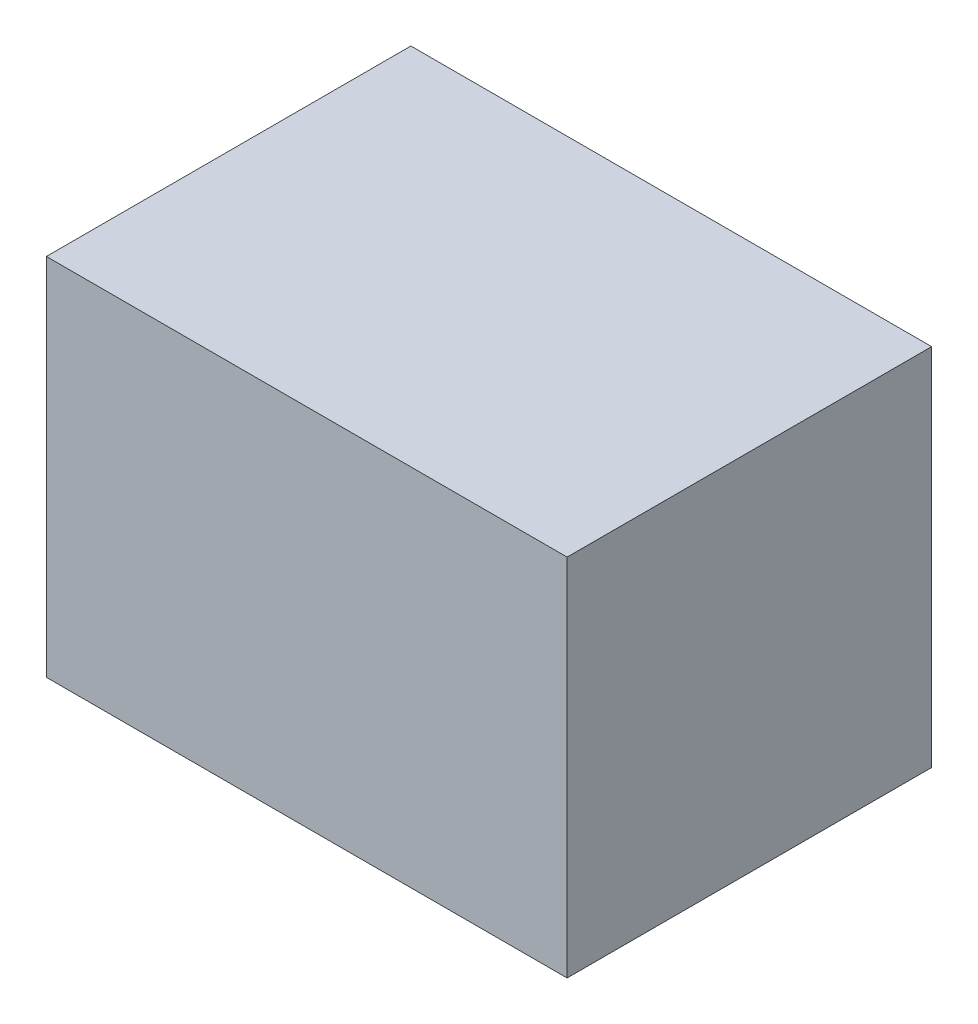
ISO-10303-21;
HEADER;
FILE_DESCRIPTION(('STEP AP214'),'2;1');
FILE_NAME('part.step','',(''),(''),'','','');
FILE_SCHEMA(('AUTOMOTIVE_DESIGN { 1 0 10303 214 1 1 1 1 }'));
ENDSEC;
DATA;
#1=APPLICATION_CONTEXT('core data for automotive mechanical design processes');
#2=APPLICATION_PROTOCOL_DEFINITION('international standard','automotive_design',2000,#1);
#3=PRODUCT_CONTEXT('',#1,'mechanical');
#4=PRODUCT('Part','Part','',(#3));
#5=PRODUCT_RELATED_PRODUCT_CATEGORY('part','',(#4));
#6=PRODUCT_DEFINITION_FORMATION('','',#4);
#7=PRODUCT_DEFINITION_CONTEXT('part definition',#1,'design');
#8=PRODUCT_DEFINITION('design','',#6,#7);
#9=PRODUCT_DEFINITION_SHAPE('','',#8);
#10=(LENGTH_UNIT() NAMED_UNIT(*) SI_UNIT(.MILLI.,.METRE.));
#11=(NAMED_UNIT(*) PLANE_ANGLE_UNIT() SI_UNIT($,.RADIAN.));
#12=(NAMED_UNIT(*) SI_UNIT($,.STERADIAN.) SOLID_ANGLE_UNIT());
#13=UNCERTAINTY_MEASURE_WITH_UNIT(LENGTH_MEASURE(1.E-05),#10,'distance_accuracy_value','');
#14=(GEOMETRIC_REPRESENTATION_CONTEXT(3) GLOBAL_UNCERTAINTY_ASSIGNED_CONTEXT((#13)) GLOBAL_UNIT_ASSIGNED_CONTEXT((#10,
#11,#12)) REPRESENTATION_CONTEXT('',''));
#15=CARTESIAN_POINT('',(0.,0.,0.));
#16=DIRECTION('',(0.,0.,1.));
#17=DIRECTION('',(1.,0.,0.));
#18=AXIS2_PLACEMENT_3D('',#15,#16,#17);
#19=CARTESIAN_POINT('',(-10.16,0.,0.));
#20=DIRECTION('',(0.,-1.,0.));
#21=DIRECTION('',(0.,0.,-1.));
#22=AXIS2_PLACEMENT_3D('',#19,#20,#21);
#23=PLANE('',#22);
#24=DIRECTION('',(1.,0.,0.));
#25=VECTOR('',#24,1.);
#26=CARTESIAN_POINT('',(-10.16,0.,-1.1));
#27=LINE('',#26,#25);
#28=CARTESIAN_POINT('',(4.83,0.,-1.1));
#29=VERTEX_POINT('',#28);
#30=CARTESIAN_POINT('',(5.33,0.,-1.1));
#31=VERTEX_POINT('',#30);
#32=EDGE_CURVE('E95',#29,#31,#27,.T.);
#33=ORIENTED_EDGE('',*,*,#32,.F.);
#34=DIRECTION('',(0.,0.,1.));
#35=VECTOR('',#34,1.);
#36=CARTESIAN_POINT('',(4.83,0.,0.));
#37=LINE('',#36,#35);
#38=CARTESIAN_POINT('',(4.83,0.,-0.75));
#39=VERTEX_POINT('',#38);
#40=EDGE_CURVE('E27',#29,#39,#37,.T.);
#41=ORIENTED_EDGE('',*,*,#40,.T.);
#42=DIRECTION('',(1.,0.,0.));
#43=VECTOR('',#42,1.);
#44=CARTESIAN_POINT('',(-10.16,0.,-0.75));
#45=LINE('',#44,#43);
#46=CARTESIAN_POINT('',(5.33,0.,-0.75));
#47=VERTEX_POINT('',#46);
#48=EDGE_CURVE('E20',#39,#47,#45,.T.);
#49=ORIENTED_EDGE('',*,*,#48,.T.);
#50=DIRECTION('',(0.,0.,1.));
#51=VECTOR('',#50,1.);
#52=CARTESIAN_POINT('',(5.33,0.,0.));
#53=LINE('',#52,#51);
#54=EDGE_CURVE('E67',#31,#47,#53,.T.);
#55=ORIENTED_EDGE('',*,*,#54,.F.);
#56=EDGE_LOOP('',(#33,#41,#49,#55));
#57=FACE_BOUND('',#56,.T.);
#58=ADVANCED_FACE('F16',(#57),#23,.F.);
#59=CARTESIAN_POINT('',(-10.16,-0.35,0.));
#60=DIRECTION('',(0.,-1.,0.));
#61=DIRECTION('',(0.,0.,-1.));
#62=AXIS2_PLACEMENT_3D('',#59,#60,#61);
#63=PLANE('',#62);
#64=DIRECTION('',(1.,0.,0.));
#65=VECTOR('',#64,1.);
#66=CARTESIAN_POINT('',(-10.16,-0.35,-1.1));
#67=LINE('',#66,#65);
#68=CARTESIAN_POINT('',(4.83,-0.35,-1.1));
#69=VERTEX_POINT('',#68);
#70=CARTESIAN_POINT('',(5.33,-0.35,-1.1));
#71=VERTEX_POINT('',#70);
#72=EDGE_CURVE('E88',#69,#71,#67,.T.);
#73=ORIENTED_EDGE('',*,*,#72,.T.);
#74=DIRECTION('',(0.,0.,1.));
#75=VECTOR('',#74,1.);
#76=CARTESIAN_POINT('',(5.33,-0.35,0.));
#77=LINE('',#76,#75);
#78=CARTESIAN_POINT('',(5.33,-0.35,-0.75));
#79=VERTEX_POINT('',#78);
#80=EDGE_CURVE('E76',#71,#79,#77,.T.);
#81=ORIENTED_EDGE('',*,*,#80,.T.);
#82=DIRECTION('',(1.,0.,0.));
#83=VECTOR('',#82,1.);
#84=CARTESIAN_POINT('',(-10.16,-0.35,-0.75));
#85=LINE('',#84,#83);
#86=CARTESIAN_POINT('',(4.83,-0.35,-0.75));
#87=VERTEX_POINT('',#86);
#88=EDGE_CURVE('E104',#87,#79,#85,.T.);
#89=ORIENTED_EDGE('',*,*,#88,.F.);
#90=DIRECTION('',(0.,0.,1.));
#91=VECTOR('',#90,1.);
#92=CARTESIAN_POINT('',(4.83,-0.35,0.));
#93=LINE('',#92,#91);
#94=EDGE_CURVE('E11',#69,#87,#93,.T.);
#95=ORIENTED_EDGE('',*,*,#94,.F.);
#96=EDGE_LOOP('',(#73,#81,#89,#95));
#97=FACE_BOUND('',#96,.T.);
#98=ADVANCED_FACE('F89',(#97),#63,.T.);
#99=CARTESIAN_POINT('',(4.83,-0.35,0.));
#100=DIRECTION('',(-1.,0.,0.));
#101=DIRECTION('',(0.,0.,1.));
#102=AXIS2_PLACEMENT_3D('',#99,#100,#101);
#103=PLANE('',#102);
#104=ORIENTED_EDGE('',*,*,#40,.F.);
#105=DIRECTION('',(0.,1.,0.));
#106=VECTOR('',#105,1.);
#107=CARTESIAN_POINT('',(4.83,-0.35,-1.1));
#108=LINE('',#107,#106);
#109=EDGE_CURVE('E93',#69,#29,#108,.T.);
#110=ORIENTED_EDGE('',*,*,#109,.F.);
#111=ORIENTED_EDGE('',*,*,#94,.T.);
#112=DIRECTION('',(0.,1.,0.));
#113=VECTOR('',#112,1.);
#114=CARTESIAN_POINT('',(4.83,-0.35,-0.75));
#115=LINE('',#114,#113);
#116=EDGE_CURVE('E106',#87,#39,#115,.T.);
#117=ORIENTED_EDGE('',*,*,#116,.T.);
#118=EDGE_LOOP('',(#104,#110,#111,#117));
#119=FACE_BOUND('',#118,.T.);
#120=ADVANCED_FACE('F18',(#119),#103,.T.);
#121=CARTESIAN_POINT('',(-10.16,-0.35,-0.75));
#122=DIRECTION('',(0.,0.,1.));
#123=DIRECTION('',(1.,0.,0.));
#124=AXIS2_PLACEMENT_3D('',#121,#122,#123);
#125=PLANE('',#124);
#126=ORIENTED_EDGE('',*,*,#48,.F.);
#127=ORIENTED_EDGE('',*,*,#116,.F.);
#128=ORIENTED_EDGE('',*,*,#88,.T.);
#129=DIRECTION('',(0.,1.,0.));
#130=VECTOR('',#129,1.);
#131=CARTESIAN_POINT('',(5.33,-0.35,-0.75));
#132=LINE('',#131,#130);
#133=EDGE_CURVE('E83',#79,#47,#132,.T.);
#134=ORIENTED_EDGE('',*,*,#133,.T.);
#135=EDGE_LOOP('',(#126,#127,#128,#134));
#136=FACE_BOUND('',#135,.T.);
#137=ADVANCED_FACE('F125',(#136),#125,.T.);
#138=CARTESIAN_POINT('',(5.33,-0.35,0.));
#139=DIRECTION('',(-1.,0.,0.));
#140=DIRECTION('',(0.,0.,1.));
#141=AXIS2_PLACEMENT_3D('',#138,#139,#140);
#142=PLANE('',#141);
#143=ORIENTED_EDGE('',*,*,#54,.T.);
#144=ORIENTED_EDGE('',*,*,#133,.F.);
#145=ORIENTED_EDGE('',*,*,#80,.F.);
#146=DIRECTION('',(0.,1.,0.));
#147=VECTOR('',#146,1.);
#148=CARTESIAN_POINT('',(5.33,-0.35,-1.1));
#149=LINE('',#148,#147);
#150=EDGE_CURVE('E80',#71,#31,#149,.T.);
#151=ORIENTED_EDGE('',*,*,#150,.T.);
#152=EDGE_LOOP('',(#143,#144,#145,#151));
#153=FACE_BOUND('',#152,.T.);
#154=ADVANCED_FACE('F78',(#153),#142,.F.);
#155=CARTESIAN_POINT('',(-10.16,-0.35,-1.1));
#156=DIRECTION('',(0.,0.,1.));
#157=DIRECTION('',(1.,0.,0.));
#158=AXIS2_PLACEMENT_3D('',#155,#156,#157);
#159=PLANE('',#158);
#160=ORIENTED_EDGE('',*,*,#32,.T.);
#161=ORIENTED_EDGE('',*,*,#150,.F.);
#162=ORIENTED_EDGE('',*,*,#72,.F.);
#163=ORIENTED_EDGE('',*,*,#109,.T.);
#164=EDGE_LOOP('',(#160,#161,#162,#163));
#165=FACE_BOUND('',#164,.T.);
#166=ADVANCED_FACE('F94',(#165),#159,.F.);
#167=CLOSED_SHELL('',(#58,#98,#120,#137,#154,#166));
#168=MANIFOLD_SOLID_BREP('B1',#167);
#169=ADVANCED_BREP_SHAPE_REPRESENTATION('',(#18,#168),#14);
#170=SHAPE_DEFINITION_REPRESENTATION(#9,#169);
ENDSEC;
END-ISO-10303-21;
